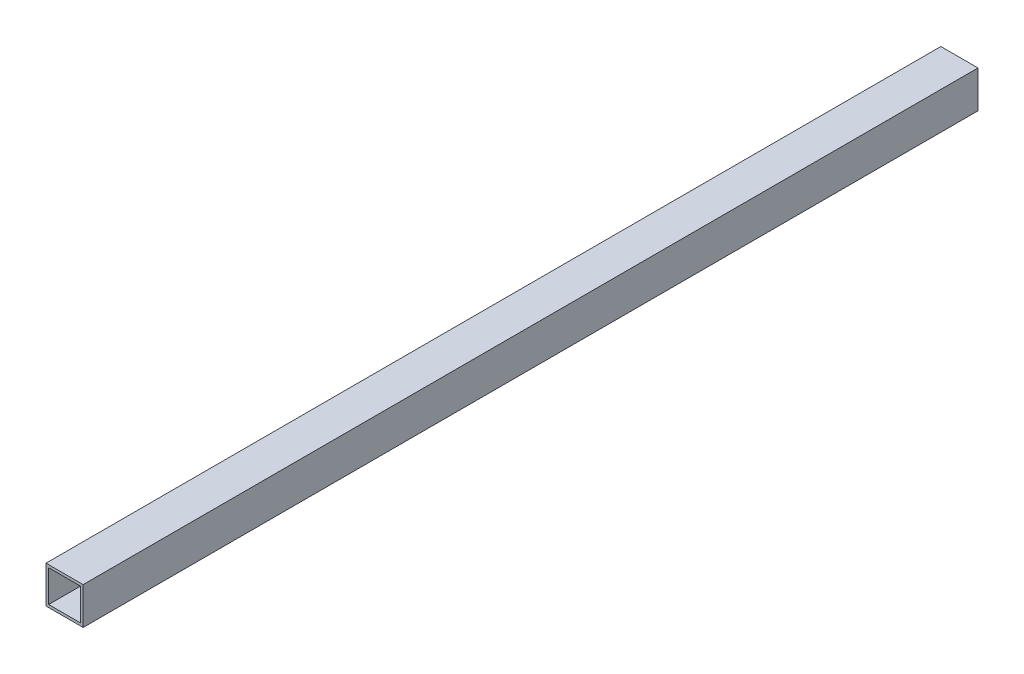
ISO-10303-21;
HEADER;
FILE_DESCRIPTION(('STEP AP214'),'2;1');
FILE_NAME('part.step','',(''),(''),'','','');
FILE_SCHEMA(('AUTOMOTIVE_DESIGN { 1 0 10303 214 1 1 1 1 }'));
ENDSEC;
DATA;
#1=APPLICATION_CONTEXT('core data for automotive mechanical design processes');
#2=APPLICATION_PROTOCOL_DEFINITION('international standard','automotive_design',2000,#1);
#3=PRODUCT_CONTEXT('',#1,'mechanical');
#4=PRODUCT('Part','Part','',(#3));
#5=PRODUCT_RELATED_PRODUCT_CATEGORY('part','',(#4));
#6=PRODUCT_DEFINITION_FORMATION('','',#4);
#7=PRODUCT_DEFINITION_CONTEXT('part definition',#1,'design');
#8=PRODUCT_DEFINITION('design','',#6,#7);
#9=PRODUCT_DEFINITION_SHAPE('','',#8);
#10=(LENGTH_UNIT() NAMED_UNIT(*) SI_UNIT(.MILLI.,.METRE.));
#11=(NAMED_UNIT(*) PLANE_ANGLE_UNIT() SI_UNIT($,.RADIAN.));
#12=(NAMED_UNIT(*) SI_UNIT($,.STERADIAN.) SOLID_ANGLE_UNIT());
#13=UNCERTAINTY_MEASURE_WITH_UNIT(LENGTH_MEASURE(1.E-05),#10,'distance_accuracy_value','');
#14=(GEOMETRIC_REPRESENTATION_CONTEXT(3) GLOBAL_UNCERTAINTY_ASSIGNED_CONTEXT((#13)) GLOBAL_UNIT_ASSIGNED_CONTEXT((#10,
#11,#12)) REPRESENTATION_CONTEXT('',''));
#15=CARTESIAN_POINT('',(0.,0.,0.));
#16=DIRECTION('',(0.,0.,1.));
#17=DIRECTION('',(1.,0.,0.));
#18=AXIS2_PLACEMENT_3D('',#15,#16,#17);
#19=CARTESIAN_POINT('',(44.45,44.45,0.));
#20=DIRECTION('',(0.,1.,0.));
#21=DIRECTION('',(0.,0.,1.));
#22=AXIS2_PLACEMENT_3D('',#19,#20,#21);
#23=PLANE('',#22);
#24=DIRECTION('',(0.,0.,-1.));
#25=VECTOR('',#24,1.);
#26=CARTESIAN_POINT('',(44.45,44.45,0.));
#27=LINE('',#26,#25);
#28=CARTESIAN_POINT('',(44.45,44.45,0.));
#29=VERTEX_POINT('',#28);
#30=CARTESIAN_POINT('',(44.45,44.45,1070.864));
#31=VERTEX_POINT('',#30);
#32=EDGE_CURVE('E114',#29,#31,#27,.F.);
#33=ORIENTED_EDGE('',*,*,#32,.F.);
#34=DIRECTION('',(1.,0.,0.));
#35=VECTOR('',#34,1.);
#36=CARTESIAN_POINT('',(0.,44.45,0.));
#37=LINE('',#36,#35);
#38=CARTESIAN_POINT('',(0.,44.45,0.));
#39=VERTEX_POINT('',#38);
#40=EDGE_CURVE('E136',#29,#39,#37,.F.);
#41=ORIENTED_EDGE('',*,*,#40,.T.);
#42=DIRECTION('',(0.,0.,1.));
#43=VECTOR('',#42,1.);
#44=CARTESIAN_POINT('',(0.,44.45,0.));
#45=LINE('',#44,#43);
#46=CARTESIAN_POINT('',(0.,44.45,1070.864));
#47=VERTEX_POINT('',#46);
#48=EDGE_CURVE('E131',#47,#39,#45,.F.);
#49=ORIENTED_EDGE('',*,*,#48,.F.);
#50=DIRECTION('',(1.,0.,0.));
#51=VECTOR('',#50,1.);
#52=CARTESIAN_POINT('',(0.,44.45,1070.864));
#53=LINE('',#52,#51);
#54=EDGE_CURVE('E106',#31,#47,#53,.F.);
#55=ORIENTED_EDGE('',*,*,#54,.F.);
#56=EDGE_LOOP('',(#33,#41,#49,#55));
#57=FACE_BOUND('',#56,.T.);
#58=ADVANCED_FACE('F17',(#57),#23,.T.);
#59=CARTESIAN_POINT('',(41.275,41.275,0.));
#60=DIRECTION('',(-1.,0.,0.));
#61=DIRECTION('',(0.,0.,1.));
#62=AXIS2_PLACEMENT_3D('',#59,#60,#61);
#63=PLANE('',#62);
#64=DIRECTION('',(0.,0.,-1.));
#65=VECTOR('',#64,1.);
#66=CARTESIAN_POINT('',(41.275,41.275,0.));
#67=LINE('',#66,#65);
#68=CARTESIAN_POINT('',(41.275,41.275,0.));
#69=VERTEX_POINT('',#68);
#70=CARTESIAN_POINT('',(41.275,41.275,1070.864));
#71=VERTEX_POINT('',#70);
#72=EDGE_CURVE('E91',#69,#71,#67,.F.);
#73=ORIENTED_EDGE('',*,*,#72,.F.);
#74=DIRECTION('',(0.,1.,0.));
#75=VECTOR('',#74,1.);
#76=CARTESIAN_POINT('',(41.275,0.,0.));
#77=LINE('',#76,#75);
#78=CARTESIAN_POINT('',(41.275,3.175,0.));
#79=VERTEX_POINT('',#78);
#80=EDGE_CURVE('E139',#69,#79,#77,.F.);
#81=ORIENTED_EDGE('',*,*,#80,.T.);
#82=DIRECTION('',(0.,0.,1.));
#83=VECTOR('',#82,1.);
#84=CARTESIAN_POINT('',(41.275,3.175,0.));
#85=LINE('',#84,#83);
#86=CARTESIAN_POINT('',(41.275,3.175,1070.864));
#87=VERTEX_POINT('',#86);
#88=EDGE_CURVE('E20',#87,#79,#85,.F.);
#89=ORIENTED_EDGE('',*,*,#88,.F.);
#90=DIRECTION('',(0.,1.,0.));
#91=VECTOR('',#90,1.);
#92=CARTESIAN_POINT('',(41.275,0.,1070.864));
#93=LINE('',#92,#91);
#94=EDGE_CURVE('E105',#71,#87,#93,.F.);
#95=ORIENTED_EDGE('',*,*,#94,.F.);
#96=EDGE_LOOP('',(#73,#81,#89,#95));
#97=FACE_BOUND('',#96,.T.);
#98=ADVANCED_FACE('F125',(#97),#63,.T.);
#99=CARTESIAN_POINT('',(41.275,3.175,0.));
#100=DIRECTION('',(0.,1.,0.));
#101=DIRECTION('',(0.,0.,1.));
#102=AXIS2_PLACEMENT_3D('',#99,#100,#101);
#103=PLANE('',#102);
#104=ORIENTED_EDGE('',*,*,#88,.T.);
#105=DIRECTION('',(1.,0.,0.));
#106=VECTOR('',#105,1.);
#107=CARTESIAN_POINT('',(0.,3.175,0.));
#108=LINE('',#107,#106);
#109=CARTESIAN_POINT('',(3.175,3.175,0.));
#110=VERTEX_POINT('',#109);
#111=EDGE_CURVE('E88',#79,#110,#108,.F.);
#112=ORIENTED_EDGE('',*,*,#111,.T.);
#113=DIRECTION('',(0.,0.,-1.));
#114=VECTOR('',#113,1.);
#115=CARTESIAN_POINT('',(3.175,3.175,0.));
#116=LINE('',#115,#114);
#117=CARTESIAN_POINT('',(3.175,3.175,1070.864));
#118=VERTEX_POINT('',#117);
#119=EDGE_CURVE('E80',#118,#110,#116,.T.);
#120=ORIENTED_EDGE('',*,*,#119,.F.);
#121=DIRECTION('',(1.,0.,0.));
#122=VECTOR('',#121,1.);
#123=CARTESIAN_POINT('',(0.,3.175,1070.864));
#124=LINE('',#123,#122);
#125=EDGE_CURVE('E85',#87,#118,#124,.F.);
#126=ORIENTED_EDGE('',*,*,#125,.F.);
#127=EDGE_LOOP('',(#104,#112,#120,#126));
#128=FACE_BOUND('',#127,.T.);
#129=ADVANCED_FACE('F83',(#128),#103,.T.);
#130=CARTESIAN_POINT('',(3.175,3.175,0.));
#131=DIRECTION('',(1.,0.,0.));
#132=DIRECTION('',(0.,0.,-1.));
#133=AXIS2_PLACEMENT_3D('',#130,#131,#132);
#134=PLANE('',#133);
#135=ORIENTED_EDGE('',*,*,#119,.T.);
#136=DIRECTION('',(0.,1.,0.));
#137=VECTOR('',#136,1.);
#138=CARTESIAN_POINT('',(3.175,0.,0.));
#139=LINE('',#138,#137);
#140=CARTESIAN_POINT('',(3.175,41.275,0.));
#141=VERTEX_POINT('',#140);
#142=EDGE_CURVE('E142',#110,#141,#139,.T.);
#143=ORIENTED_EDGE('',*,*,#142,.T.);
#144=DIRECTION('',(0.,0.,-1.));
#145=VECTOR('',#144,1.);
#146=CARTESIAN_POINT('',(3.175,41.275,0.));
#147=LINE('',#146,#145);
#148=CARTESIAN_POINT('',(3.175,41.275,1070.864));
#149=VERTEX_POINT('',#148);
#150=EDGE_CURVE('E96',#149,#141,#147,.T.);
#151=ORIENTED_EDGE('',*,*,#150,.F.);
#152=DIRECTION('',(0.,1.,0.));
#153=VECTOR('',#152,1.);
#154=CARTESIAN_POINT('',(3.175,0.,1070.864));
#155=LINE('',#154,#153);
#156=EDGE_CURVE('E93',#118,#149,#155,.T.);
#157=ORIENTED_EDGE('',*,*,#156,.F.);
#158=EDGE_LOOP('',(#135,#143,#151,#157));
#159=FACE_BOUND('',#158,.T.);
#160=ADVANCED_FACE('F94',(#159),#134,.T.);
#161=CARTESIAN_POINT('',(3.175,41.275,0.));
#162=DIRECTION('',(0.,-1.,0.));
#163=DIRECTION('',(0.,0.,-1.));
#164=AXIS2_PLACEMENT_3D('',#161,#162,#163);
#165=PLANE('',#164);
#166=ORIENTED_EDGE('',*,*,#150,.T.);
#167=DIRECTION('',(1.,0.,0.));
#168=VECTOR('',#167,1.);
#169=CARTESIAN_POINT('',(0.,41.275,0.));
#170=LINE('',#169,#168);
#171=EDGE_CURVE('E122',#141,#69,#170,.T.);
#172=ORIENTED_EDGE('',*,*,#171,.T.);
#173=ORIENTED_EDGE('',*,*,#72,.T.);
#174=DIRECTION('',(1.,0.,0.));
#175=VECTOR('',#174,1.);
#176=CARTESIAN_POINT('',(0.,41.275,1070.864));
#177=LINE('',#176,#175);
#178=EDGE_CURVE('E100',#149,#71,#177,.T.);
#179=ORIENTED_EDGE('',*,*,#178,.F.);
#180=EDGE_LOOP('',(#166,#172,#173,#179));
#181=FACE_BOUND('',#180,.T.);
#182=ADVANCED_FACE('F120',(#181),#165,.T.);
#183=CARTESIAN_POINT('',(44.45,0.,0.));
#184=DIRECTION('',(1.,0.,0.));
#185=DIRECTION('',(0.,0.,-1.));
#186=AXIS2_PLACEMENT_3D('',#183,#184,#185);
#187=PLANE('',#186);
#188=DIRECTION('',(0.,0.,-1.));
#189=VECTOR('',#188,1.);
#190=CARTESIAN_POINT('',(44.45,0.,0.));
#191=LINE('',#190,#189);
#192=CARTESIAN_POINT('',(44.45,0.,0.));
#193=VERTEX_POINT('',#192);
#194=CARTESIAN_POINT('',(44.45,0.,1070.864));
#195=VERTEX_POINT('',#194);
#196=EDGE_CURVE('E145',#193,#195,#191,.F.);
#197=ORIENTED_EDGE('',*,*,#196,.F.);
#198=DIRECTION('',(0.,1.,0.));
#199=VECTOR('',#198,1.);
#200=CARTESIAN_POINT('',(44.45,0.,0.));
#201=LINE('',#200,#199);
#202=EDGE_CURVE('E133',#193,#29,#201,.T.);
#203=ORIENTED_EDGE('',*,*,#202,.T.);
#204=ORIENTED_EDGE('',*,*,#32,.T.);
#205=DIRECTION('',(0.,1.,0.));
#206=VECTOR('',#205,1.);
#207=CARTESIAN_POINT('',(44.45,0.,1070.864));
#208=LINE('',#207,#206);
#209=EDGE_CURVE('E108',#195,#31,#208,.T.);
#210=ORIENTED_EDGE('',*,*,#209,.F.);
#211=EDGE_LOOP('',(#197,#203,#204,#210));
#212=FACE_BOUND('',#211,.T.);
#213=ADVANCED_FACE('F164',(#212),#187,.T.);
#214=CARTESIAN_POINT('',(0.,0.,1070.864));
#215=DIRECTION('',(0.,0.,1.));
#216=DIRECTION('',(1.,0.,0.));
#217=AXIS2_PLACEMENT_3D('',#214,#215,#216);
#218=PLANE('',#217);
#219=ORIENTED_EDGE('',*,*,#178,.T.);
#220=ORIENTED_EDGE('',*,*,#94,.T.);
#221=ORIENTED_EDGE('',*,*,#125,.T.);
#222=ORIENTED_EDGE('',*,*,#156,.T.);
#223=EDGE_LOOP('',(#219,#220,#221,#222));
#224=FACE_BOUND('',#223,.T.);
#225=DIRECTION('',(0.,1.,0.));
#226=VECTOR('',#225,1.);
#227=CARTESIAN_POINT('',(0.,44.45,1070.864));
#228=LINE('',#227,#226);
#229=CARTESIAN_POINT('',(0.,0.,1070.864));
#230=VERTEX_POINT('',#229);
#231=EDGE_CURVE('E126',#230,#47,#228,.T.);
#232=ORIENTED_EDGE('',*,*,#231,.F.);
#233=DIRECTION('',(1.,0.,0.));
#234=VECTOR('',#233,1.);
#235=CARTESIAN_POINT('',(0.,0.,1070.864));
#236=LINE('',#235,#234);
#237=EDGE_CURVE('E148',#195,#230,#236,.F.);
#238=ORIENTED_EDGE('',*,*,#237,.F.);
#239=ORIENTED_EDGE('',*,*,#209,.T.);
#240=ORIENTED_EDGE('',*,*,#54,.T.);
#241=EDGE_LOOP('',(#232,#238,#239,#240));
#242=FACE_BOUND('',#241,.T.);
#243=ADVANCED_FACE('F102',(#224,#242),#218,.T.);
#244=CARTESIAN_POINT('',(0.,44.45,0.));
#245=DIRECTION('',(-1.,0.,0.));
#246=DIRECTION('',(0.,0.,1.));
#247=AXIS2_PLACEMENT_3D('',#244,#245,#246);
#248=PLANE('',#247);
#249=ORIENTED_EDGE('',*,*,#48,.T.);
#250=DIRECTION('',(0.,1.,0.));
#251=VECTOR('',#250,1.);
#252=CARTESIAN_POINT('',(0.,0.,0.));
#253=LINE('',#252,#251);
#254=CARTESIAN_POINT('',(0.,0.,0.));
#255=VERTEX_POINT('',#254);
#256=EDGE_CURVE('E35',#39,#255,#253,.F.);
#257=ORIENTED_EDGE('',*,*,#256,.T.);
#258=DIRECTION('',(0.,0.,-1.));
#259=VECTOR('',#258,1.);
#260=CARTESIAN_POINT('',(0.,0.,0.));
#261=LINE('',#260,#259);
#262=EDGE_CURVE('E26',#230,#255,#261,.T.);
#263=ORIENTED_EDGE('',*,*,#262,.F.);
#264=ORIENTED_EDGE('',*,*,#231,.T.);
#265=EDGE_LOOP('',(#249,#257,#263,#264));
#266=FACE_BOUND('',#265,.T.);
#267=ADVANCED_FACE('F155',(#266),#248,.T.);
#268=CARTESIAN_POINT('',(0.,0.,0.));
#269=DIRECTION('',(0.,0.,1.));
#270=DIRECTION('',(1.,0.,0.));
#271=AXIS2_PLACEMENT_3D('',#268,#269,#270);
#272=PLANE('',#271);
#273=ORIENTED_EDGE('',*,*,#142,.F.);
#274=ORIENTED_EDGE('',*,*,#111,.F.);
#275=ORIENTED_EDGE('',*,*,#80,.F.);
#276=ORIENTED_EDGE('',*,*,#171,.F.);
#277=EDGE_LOOP('',(#273,#274,#275,#276));
#278=FACE_BOUND('',#277,.T.);
#279=ORIENTED_EDGE('',*,*,#40,.F.);
#280=ORIENTED_EDGE('',*,*,#202,.F.);
#281=DIRECTION('',(1.,0.,0.));
#282=VECTOR('',#281,1.);
#283=CARTESIAN_POINT('',(0.,0.,0.));
#284=LINE('',#283,#282);
#285=EDGE_CURVE('E11',#255,#193,#284,.T.);
#286=ORIENTED_EDGE('',*,*,#285,.F.);
#287=ORIENTED_EDGE('',*,*,#256,.F.);
#288=EDGE_LOOP('',(#279,#280,#286,#287));
#289=FACE_BOUND('',#288,.T.);
#290=ADVANCED_FACE('F162',(#278,#289),#272,.F.);
#291=CARTESIAN_POINT('',(0.,0.,0.));
#292=DIRECTION('',(0.,-1.,0.));
#293=DIRECTION('',(0.,0.,-1.));
#294=AXIS2_PLACEMENT_3D('',#291,#292,#293);
#295=PLANE('',#294);
#296=ORIENTED_EDGE('',*,*,#262,.T.);
#297=ORIENTED_EDGE('',*,*,#285,.T.);
#298=ORIENTED_EDGE('',*,*,#196,.T.);
#299=ORIENTED_EDGE('',*,*,#237,.T.);
#300=EDGE_LOOP('',(#296,#297,#298,#299));
#301=FACE_BOUND('',#300,.T.);
#302=ADVANCED_FACE('F153',(#301),#295,.T.);
#303=CLOSED_SHELL('',(#58,#98,#129,#160,#182,#213,#243,#267,#290,#302));
#304=MANIFOLD_SOLID_BREP('B1',#303);
#305=ADVANCED_BREP_SHAPE_REPRESENTATION('',(#18,#304),#14);
#306=SHAPE_DEFINITION_REPRESENTATION(#9,#305);
ENDSEC;
END-ISO-10303-21;
